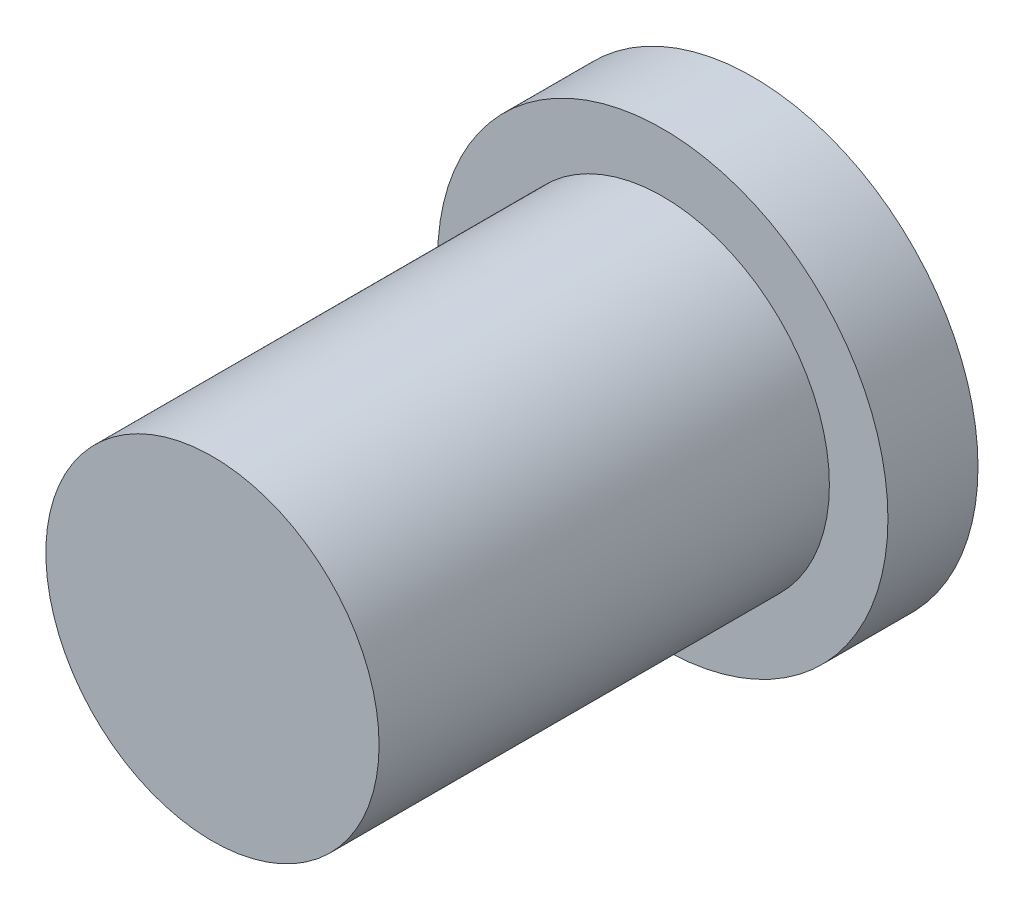
ISO-10303-21;
HEADER;
FILE_DESCRIPTION(('STEP AP214'),'2;1');
FILE_NAME('part.step','',(''),(''),'','','');
FILE_SCHEMA(('AUTOMOTIVE_DESIGN { 1 0 10303 214 1 1 1 1 }'));
ENDSEC;
DATA;
#1=APPLICATION_CONTEXT('core data for automotive mechanical design processes');
#2=APPLICATION_PROTOCOL_DEFINITION('international standard','automotive_design',2000,#1);
#3=PRODUCT_CONTEXT('',#1,'mechanical');
#4=PRODUCT('Part','Part','',(#3));
#5=PRODUCT_RELATED_PRODUCT_CATEGORY('part','',(#4));
#6=PRODUCT_DEFINITION_FORMATION('','',#4);
#7=PRODUCT_DEFINITION_CONTEXT('part definition',#1,'design');
#8=PRODUCT_DEFINITION('design','',#6,#7);
#9=PRODUCT_DEFINITION_SHAPE('','',#8);
#10=(LENGTH_UNIT() NAMED_UNIT(*) SI_UNIT(.MILLI.,.METRE.));
#11=(NAMED_UNIT(*) PLANE_ANGLE_UNIT() SI_UNIT($,.RADIAN.));
#12=(NAMED_UNIT(*) SI_UNIT($,.STERADIAN.) SOLID_ANGLE_UNIT());
#13=UNCERTAINTY_MEASURE_WITH_UNIT(LENGTH_MEASURE(1.E-05),#10,'distance_accuracy_value','');
#14=(GEOMETRIC_REPRESENTATION_CONTEXT(3) GLOBAL_UNCERTAINTY_ASSIGNED_CONTEXT((#13)) GLOBAL_UNIT_ASSIGNED_CONTEXT((#10,
#11,#12)) REPRESENTATION_CONTEXT('',''));
#15=CARTESIAN_POINT('',(0.,0.,0.));
#16=DIRECTION('',(0.,0.,1.));
#17=DIRECTION('',(1.,0.,0.));
#18=AXIS2_PLACEMENT_3D('',#15,#16,#17);
#19=CARTESIAN_POINT('',(0.,0.,10.));
#20=DIRECTION('',(0.,0.,-1.));
#21=DIRECTION('',(-1.,0.,0.));
#22=AXIS2_PLACEMENT_3D('',#19,#20,#21);
#23=CYLINDRICAL_SURFACE('',#22,3.7);
#24=CARTESIAN_POINT('',(0.,0.,10.));
#25=DIRECTION('',(0.,0.,1.));
#26=DIRECTION('',(1.,0.,0.));
#27=AXIS2_PLACEMENT_3D('',#24,#25,#26);
#28=CIRCLE('',#27,3.7);
#29=CARTESIAN_POINT('',(3.7,0.,10.));
#30=VERTEX_POINT('',#29);
#31=EDGE_CURVE('E10',#30,#30,#28,.T.);
#32=ORIENTED_EDGE('',*,*,#31,.F.);
#33=EDGE_LOOP('',(#32));
#34=FACE_BOUND('',#33,.T.);
#35=CARTESIAN_POINT('',(0.,0.,0.));
#36=DIRECTION('',(0.,0.,1.));
#37=DIRECTION('',(1.,0.,0.));
#38=AXIS2_PLACEMENT_3D('',#35,#36,#37);
#39=CIRCLE('',#38,3.7);
#40=CARTESIAN_POINT('',(3.7,0.,0.));
#41=VERTEX_POINT('',#40);
#42=EDGE_CURVE('E36',#41,#41,#39,.T.);
#43=ORIENTED_EDGE('',*,*,#42,.T.);
#44=EDGE_LOOP('',(#43));
#45=FACE_BOUND('',#44,.T.);
#46=ADVANCED_FACE('F33',(#34,#45),#23,.T.);
#47=CARTESIAN_POINT('',(0.,0.,10.));
#48=DIRECTION('',(0.,0.,1.));
#49=DIRECTION('',(1.,0.,0.));
#50=AXIS2_PLACEMENT_3D('',#47,#48,#49);
#51=PLANE('',#50);
#52=ORIENTED_EDGE('',*,*,#31,.T.);
#53=EDGE_LOOP('',(#52));
#54=FACE_BOUND('',#53,.T.);
#55=ADVANCED_FACE('F56',(#54),#51,.T.);
#56=CARTESIAN_POINT('',(0.,0.,-2.));
#57=DIRECTION('',(0.,0.,1.));
#58=DIRECTION('',(1.,0.,0.));
#59=AXIS2_PLACEMENT_3D('',#56,#57,#58);
#60=CYLINDRICAL_SURFACE('',#59,5.);
#61=CARTESIAN_POINT('',(0.,0.,-2.));
#62=DIRECTION('',(0.,0.,-1.));
#63=DIRECTION('',(-1.,0.,0.));
#64=AXIS2_PLACEMENT_3D('',#61,#62,#63);
#65=CIRCLE('',#64,5.);
#66=CARTESIAN_POINT('',(-5.,0.,-2.));
#67=VERTEX_POINT('',#66);
#68=EDGE_CURVE('E43',#67,#67,#65,.T.);
#69=ORIENTED_EDGE('',*,*,#68,.F.);
#70=EDGE_LOOP('',(#69));
#71=FACE_BOUND('',#70,.T.);
#72=CARTESIAN_POINT('',(0.,0.,0.));
#73=DIRECTION('',(0.,0.,-1.));
#74=DIRECTION('',(-1.,0.,0.));
#75=AXIS2_PLACEMENT_3D('',#72,#73,#74);
#76=CIRCLE('',#75,5.);
#77=CARTESIAN_POINT('',(-5.,0.,0.));
#78=VERTEX_POINT('',#77);
#79=EDGE_CURVE('E45',#78,#78,#76,.T.);
#80=ORIENTED_EDGE('',*,*,#79,.T.);
#81=EDGE_LOOP('',(#80));
#82=FACE_BOUND('',#81,.T.);
#83=ADVANCED_FACE('F53',(#71,#82),#60,.T.);
#84=CARTESIAN_POINT('',(0.,0.,-2.));
#85=DIRECTION('',(0.,0.,-1.));
#86=DIRECTION('',(-1.,0.,0.));
#87=AXIS2_PLACEMENT_3D('',#84,#85,#86);
#88=PLANE('',#87);
#89=ORIENTED_EDGE('',*,*,#68,.T.);
#90=EDGE_LOOP('',(#89));
#91=FACE_BOUND('',#90,.T.);
#92=ADVANCED_FACE('F51',(#91),#88,.T.);
#93=CARTESIAN_POINT('',(0.,0.,0.));
#94=DIRECTION('',(0.,0.,-1.));
#95=DIRECTION('',(-1.,0.,0.));
#96=AXIS2_PLACEMENT_3D('',#93,#94,#95);
#97=PLANE('',#96);
#98=ORIENTED_EDGE('',*,*,#42,.F.);
#99=EDGE_LOOP('',(#98));
#100=FACE_BOUND('',#99,.T.);
#101=ORIENTED_EDGE('',*,*,#79,.F.);
#102=EDGE_LOOP('',(#101));
#103=FACE_BOUND('',#102,.T.);
#104=ADVANCED_FACE('F60',(#100,#103),#97,.F.);
#105=CLOSED_SHELL('',(#46,#55,#83,#92,#104));
#106=MANIFOLD_SOLID_BREP('B2',#105);
#107=ADVANCED_BREP_SHAPE_REPRESENTATION('',(#18,#106),#14);
#108=SHAPE_DEFINITION_REPRESENTATION(#9,#107);
ENDSEC;
END-ISO-10303-21;
